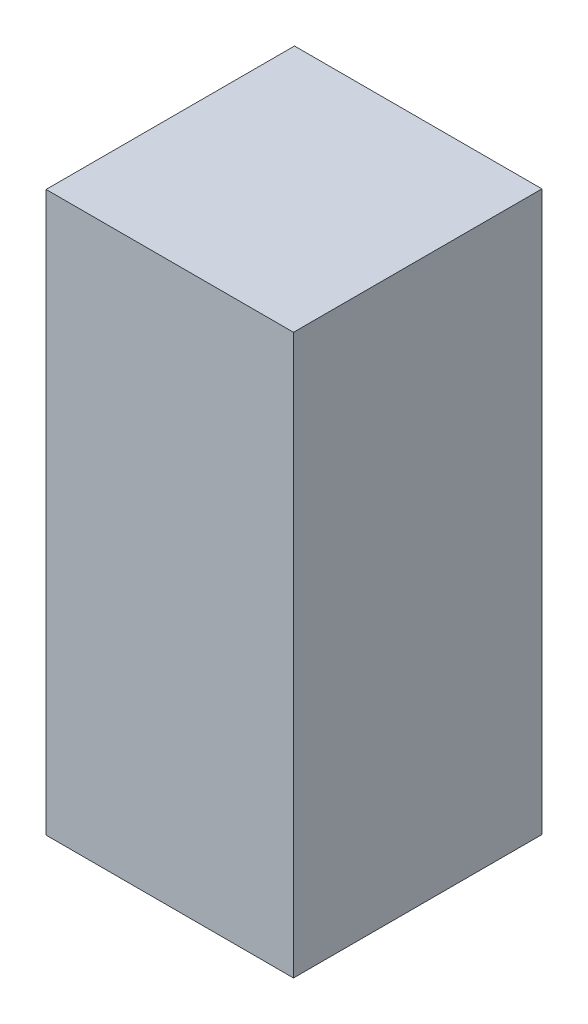
ISO-10303-21;
HEADER;
FILE_DESCRIPTION(('STEP AP214'),'2;1');
FILE_NAME('part.step','',(''),(''),'','','');
FILE_SCHEMA(('AUTOMOTIVE_DESIGN { 1 0 10303 214 1 1 1 1 }'));
ENDSEC;
DATA;
#1=APPLICATION_CONTEXT('core data for automotive mechanical design processes');
#2=APPLICATION_PROTOCOL_DEFINITION('international standard','automotive_design',2000,#1);
#3=PRODUCT_CONTEXT('',#1,'mechanical');
#4=PRODUCT('Part','Part','',(#3));
#5=PRODUCT_RELATED_PRODUCT_CATEGORY('part','',(#4));
#6=PRODUCT_DEFINITION_FORMATION('','',#4);
#7=PRODUCT_DEFINITION_CONTEXT('part definition',#1,'design');
#8=PRODUCT_DEFINITION('design','',#6,#7);
#9=PRODUCT_DEFINITION_SHAPE('','',#8);
#10=(LENGTH_UNIT() NAMED_UNIT(*) SI_UNIT(.MILLI.,.METRE.));
#11=(NAMED_UNIT(*) PLANE_ANGLE_UNIT() SI_UNIT($,.RADIAN.));
#12=(NAMED_UNIT(*) SI_UNIT($,.STERADIAN.) SOLID_ANGLE_UNIT());
#13=UNCERTAINTY_MEASURE_WITH_UNIT(LENGTH_MEASURE(1.E-05),#10,'distance_accuracy_value','');
#14=(GEOMETRIC_REPRESENTATION_CONTEXT(3) GLOBAL_UNCERTAINTY_ASSIGNED_CONTEXT((#13)) GLOBAL_UNIT_ASSIGNED_CONTEXT((#10,
#11,#12)) REPRESENTATION_CONTEXT('',''));
#15=CARTESIAN_POINT('',(0.,0.,0.));
#16=DIRECTION('',(0.,0.,1.));
#17=DIRECTION('',(1.,0.,0.));
#18=AXIS2_PLACEMENT_3D('',#15,#16,#17);
#19=CARTESIAN_POINT('',(-1.98755,2.31245,0.));
#20=DIRECTION('',(1.,0.,0.));
#21=DIRECTION('',(0.,0.,1.));
#22=AXIS2_PLACEMENT_3D('',#19,#20,#21);
#23=PLANE('',#22);
#24=DIRECTION('',(0.,1.,0.));
#25=VECTOR('',#24,1.);
#26=CARTESIAN_POINT('',(-1.98755,2.31245,0.1));
#27=LINE('',#26,#25);
#28=CARTESIAN_POINT('',(-1.98755,2.31245,0.1));
#29=VERTEX_POINT('',#28);
#30=CARTESIAN_POINT('',(-1.98755,2.53755,0.1));
#31=VERTEX_POINT('',#30);
#32=EDGE_CURVE('E11',#29,#31,#27,.T.);
#33=ORIENTED_EDGE('',*,*,#32,.T.);
#34=DIRECTION('',(0.,0.,1.));
#35=VECTOR('',#34,1.);
#36=CARTESIAN_POINT('',(-1.98755,2.53755,0.));
#37=LINE('',#36,#35);
#38=CARTESIAN_POINT('',(-1.98755,2.53755,0.));
#39=VERTEX_POINT('',#38);
#40=EDGE_CURVE('E24',#39,#31,#37,.T.);
#41=ORIENTED_EDGE('',*,*,#40,.F.);
#42=DIRECTION('',(0.,1.,0.));
#43=VECTOR('',#42,1.);
#44=CARTESIAN_POINT('',(-1.98755,2.31245,0.));
#45=LINE('',#44,#43);
#46=CARTESIAN_POINT('',(-1.98755,2.31245,0.));
#47=VERTEX_POINT('',#46);
#48=EDGE_CURVE('E86',#47,#39,#45,.T.);
#49=ORIENTED_EDGE('',*,*,#48,.F.);
#50=DIRECTION('',(0.,0.,1.));
#51=VECTOR('',#50,1.);
#52=CARTESIAN_POINT('',(-1.98755,2.31245,0.));
#53=LINE('',#52,#51);
#54=EDGE_CURVE('E36',#47,#29,#53,.T.);
#55=ORIENTED_EDGE('',*,*,#54,.T.);
#56=EDGE_LOOP('',(#33,#41,#49,#55));
#57=FACE_BOUND('',#56,.T.);
#58=ADVANCED_FACE('F17',(#57),#23,.F.);
#59=CARTESIAN_POINT('',(-1.88795,2.31245,0.));
#60=DIRECTION('',(1.,0.,0.));
#61=DIRECTION('',(0.,0.,1.));
#62=AXIS2_PLACEMENT_3D('',#59,#60,#61);
#63=PLANE('',#62);
#64=DIRECTION('',(0.,0.,1.));
#65=VECTOR('',#64,1.);
#66=CARTESIAN_POINT('',(-1.88795,2.31245,0.));
#67=LINE('',#66,#65);
#68=CARTESIAN_POINT('',(-1.88795,2.31245,0.));
#69=VERTEX_POINT('',#68);
#70=CARTESIAN_POINT('',(-1.88795,2.31245,0.1));
#71=VERTEX_POINT('',#70);
#72=EDGE_CURVE('E83',#69,#71,#67,.T.);
#73=ORIENTED_EDGE('',*,*,#72,.F.);
#74=DIRECTION('',(0.,1.,0.));
#75=VECTOR('',#74,1.);
#76=CARTESIAN_POINT('',(-1.88795,2.31245,0.));
#77=LINE('',#76,#75);
#78=CARTESIAN_POINT('',(-1.88795,2.53755,0.));
#79=VERTEX_POINT('',#78);
#80=EDGE_CURVE('E63',#69,#79,#77,.T.);
#81=ORIENTED_EDGE('',*,*,#80,.T.);
#82=DIRECTION('',(0.,0.,1.));
#83=VECTOR('',#82,1.);
#84=CARTESIAN_POINT('',(-1.88795,2.53755,0.));
#85=LINE('',#84,#83);
#86=CARTESIAN_POINT('',(-1.88795,2.53755,0.1));
#87=VERTEX_POINT('',#86);
#88=EDGE_CURVE('E57',#79,#87,#85,.T.);
#89=ORIENTED_EDGE('',*,*,#88,.T.);
#90=DIRECTION('',(0.,1.,0.));
#91=VECTOR('',#90,1.);
#92=CARTESIAN_POINT('',(-1.88795,2.31245,0.1));
#93=LINE('',#92,#91);
#94=EDGE_CURVE('E60',#71,#87,#93,.T.);
#95=ORIENTED_EDGE('',*,*,#94,.F.);
#96=EDGE_LOOP('',(#73,#81,#89,#95));
#97=FACE_BOUND('',#96,.T.);
#98=ADVANCED_FACE('F59',(#97),#63,.T.);
#99=CARTESIAN_POINT('',(-1.98755,2.31245,0.));
#100=DIRECTION('',(0.,1.,0.));
#101=DIRECTION('',(0.,0.,1.));
#102=AXIS2_PLACEMENT_3D('',#99,#100,#101);
#103=PLANE('',#102);
#104=ORIENTED_EDGE('',*,*,#72,.T.);
#105=DIRECTION('',(1.,0.,0.));
#106=VECTOR('',#105,1.);
#107=CARTESIAN_POINT('',(-1.98755,2.31245,0.1));
#108=LINE('',#107,#106);
#109=EDGE_CURVE('E71',#29,#71,#108,.T.);
#110=ORIENTED_EDGE('',*,*,#109,.F.);
#111=ORIENTED_EDGE('',*,*,#54,.F.);
#112=DIRECTION('',(1.,0.,0.));
#113=VECTOR('',#112,1.);
#114=CARTESIAN_POINT('',(-1.98755,2.31245,0.));
#115=LINE('',#114,#113);
#116=EDGE_CURVE('E76',#47,#69,#115,.T.);
#117=ORIENTED_EDGE('',*,*,#116,.T.);
#118=EDGE_LOOP('',(#104,#110,#111,#117));
#119=FACE_BOUND('',#118,.T.);
#120=ADVANCED_FACE('F91',(#119),#103,.F.);
#121=CARTESIAN_POINT('',(-1.98755,2.53755,0.));
#122=DIRECTION('',(0.,1.,0.));
#123=DIRECTION('',(0.,0.,1.));
#124=AXIS2_PLACEMENT_3D('',#121,#122,#123);
#125=PLANE('',#124);
#126=DIRECTION('',(1.,0.,0.));
#127=VECTOR('',#126,1.);
#128=CARTESIAN_POINT('',(-1.98755,2.53755,0.));
#129=LINE('',#128,#127);
#130=EDGE_CURVE('E74',#39,#79,#129,.T.);
#131=ORIENTED_EDGE('',*,*,#130,.F.);
#132=ORIENTED_EDGE('',*,*,#40,.T.);
#133=DIRECTION('',(1.,0.,0.));
#134=VECTOR('',#133,1.);
#135=CARTESIAN_POINT('',(-1.98755,2.53755,0.1));
#136=LINE('',#135,#134);
#137=EDGE_CURVE('E69',#31,#87,#136,.T.);
#138=ORIENTED_EDGE('',*,*,#137,.T.);
#139=ORIENTED_EDGE('',*,*,#88,.F.);
#140=EDGE_LOOP('',(#131,#132,#138,#139));
#141=FACE_BOUND('',#140,.T.);
#142=ADVANCED_FACE('F73',(#141),#125,.T.);
#143=CARTESIAN_POINT('',(-1.98755,2.31245,0.));
#144=DIRECTION('',(0.,0.,1.));
#145=DIRECTION('',(1.,0.,0.));
#146=AXIS2_PLACEMENT_3D('',#143,#144,#145);
#147=PLANE('',#146);
#148=ORIENTED_EDGE('',*,*,#130,.T.);
#149=ORIENTED_EDGE('',*,*,#80,.F.);
#150=ORIENTED_EDGE('',*,*,#116,.F.);
#151=ORIENTED_EDGE('',*,*,#48,.T.);
#152=EDGE_LOOP('',(#148,#149,#150,#151));
#153=FACE_BOUND('',#152,.T.);
#154=ADVANCED_FACE('F89',(#153),#147,.F.);
#155=CARTESIAN_POINT('',(-1.98755,2.31245,0.1));
#156=DIRECTION('',(0.,0.,1.));
#157=DIRECTION('',(1.,0.,0.));
#158=AXIS2_PLACEMENT_3D('',#155,#156,#157);
#159=PLANE('',#158);
#160=ORIENTED_EDGE('',*,*,#32,.F.);
#161=ORIENTED_EDGE('',*,*,#109,.T.);
#162=ORIENTED_EDGE('',*,*,#94,.T.);
#163=ORIENTED_EDGE('',*,*,#137,.F.);
#164=EDGE_LOOP('',(#160,#161,#162,#163));
#165=FACE_BOUND('',#164,.T.);
#166=ADVANCED_FACE('F68',(#165),#159,.T.);
#167=CLOSED_SHELL('',(#58,#98,#120,#142,#154,#166));
#168=MANIFOLD_SOLID_BREP('B1',#167);
#169=ADVANCED_BREP_SHAPE_REPRESENTATION('',(#18,#168),#14);
#170=SHAPE_DEFINITION_REPRESENTATION(#9,#169);
ENDSEC;
END-ISO-10303-21;
